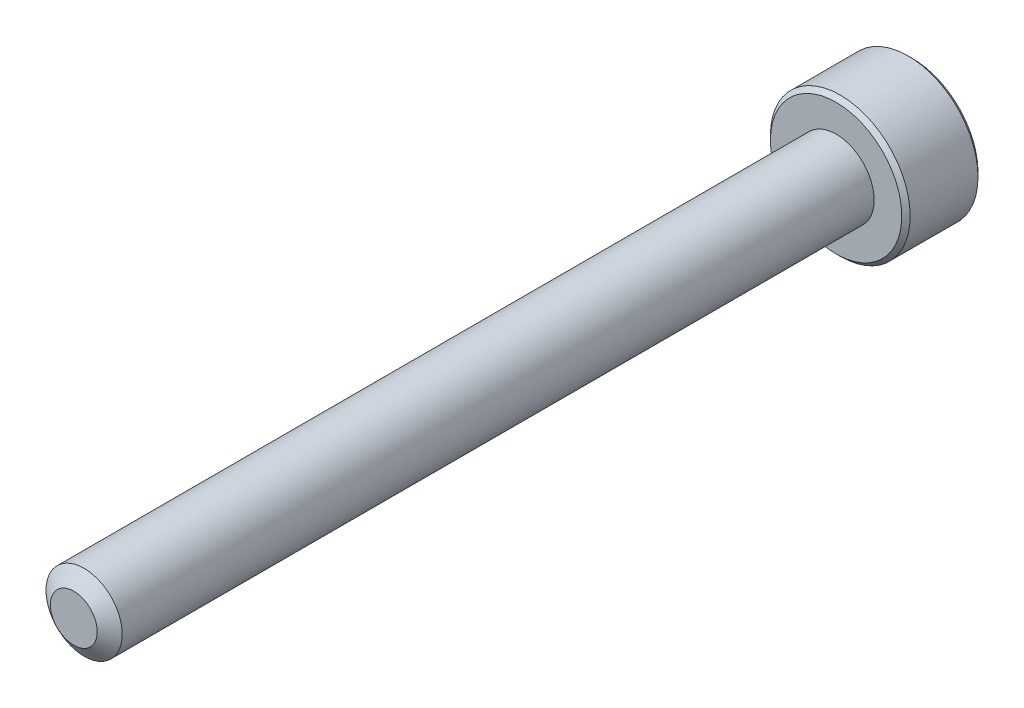
ISO-10303-21;
HEADER;
FILE_DESCRIPTION(('STEP AP214'),'2;1');
FILE_NAME('part.step','',(''),(''),'','','');
FILE_SCHEMA(('AUTOMOTIVE_DESIGN { 1 0 10303 214 1 1 1 1 }'));
ENDSEC;
DATA;
#1=APPLICATION_CONTEXT('core data for automotive mechanical design processes');
#2=APPLICATION_PROTOCOL_DEFINITION('international standard','automotive_design',2000,#1);
#3=PRODUCT_CONTEXT('',#1,'mechanical');
#4=PRODUCT('Part','Part','',(#3));
#5=PRODUCT_RELATED_PRODUCT_CATEGORY('part','',(#4));
#6=PRODUCT_DEFINITION_FORMATION('','',#4);
#7=PRODUCT_DEFINITION_CONTEXT('part definition',#1,'design');
#8=PRODUCT_DEFINITION('design','',#6,#7);
#9=PRODUCT_DEFINITION_SHAPE('','',#8);
#10=(LENGTH_UNIT() NAMED_UNIT(*) SI_UNIT(.MILLI.,.METRE.));
#11=(NAMED_UNIT(*) PLANE_ANGLE_UNIT() SI_UNIT($,.RADIAN.));
#12=(NAMED_UNIT(*) SI_UNIT($,.STERADIAN.) SOLID_ANGLE_UNIT());
#13=UNCERTAINTY_MEASURE_WITH_UNIT(LENGTH_MEASURE(1.E-05),#10,'distance_accuracy_value','');
#14=(GEOMETRIC_REPRESENTATION_CONTEXT(3) GLOBAL_UNCERTAINTY_ASSIGNED_CONTEXT((#13)) GLOBAL_UNIT_ASSIGNED_CONTEXT((#10,
#11,#12)) REPRESENTATION_CONTEXT('',''));
#15=CARTESIAN_POINT('',(0.,0.,0.));
#16=DIRECTION('',(0.,0.,1.));
#17=DIRECTION('',(1.,0.,0.));
#18=AXIS2_PLACEMENT_3D('',#15,#16,#17);
#19=CARTESIAN_POINT('',(0.,-1.44337567297406,-31.125));
#20=DIRECTION('',(-0.5,-0.866025403784439,0.));
#21=DIRECTION('',(0.866025403784439,-0.5,0.));
#22=AXIS2_PLACEMENT_3D('',#19,#20,#21);
#23=PLANE('',#22);
#24=CARTESIAN_POINT('',(-1.24999999999719,-0.721687836488653,-33.0000000000106));
#25=CARTESIAN_POINT('',(-1.20703689149334,-0.746492598748569,-32.9752190397288));
#26=CARTESIAN_POINT('',(-1.16335543595188,-0.771712098864028,-32.9518937494737));
#27=CARTESIAN_POINT('',(-1.07428446543455,-0.823137247669188,-32.9091861389212));
#28=CARTESIAN_POINT('',(-1.02888648443341,-0.849347784220863,-32.8898275733605));
#29=CARTESIAN_POINT('',(-0.937343688520915,-0.902200042083313,-32.8566662159147));
#30=CARTESIAN_POINT('',(-0.891222174140705,-0.928828310826161,-32.8427800967852));
#31=CARTESIAN_POINT('',(-0.79796403889092,-0.982670920316747,-32.8213859018018));
#32=CARTESIAN_POINT('',(-0.750830264933392,-1.00988361739905,-32.8138618619237));
#33=CARTESIAN_POINT('',(-0.669590913521733,-1.05678717880536,-32.8070728277984));
#34=CARTESIAN_POINT('',(-0.635590177984294,-1.07641751262055,-32.8060681886569));
#35=CARTESIAN_POINT('',(-0.567648554675317,-1.11564362712716,-32.8077634952234));
#36=CARTESIAN_POINT('',(-0.533707681782074,-1.13523939922861,-32.8104642592638));
#37=CARTESIAN_POINT('',(-0.466153619735585,-1.174241755136,-32.8194142483472));
#38=CARTESIAN_POINT('',(-0.432540764897262,-1.19364814592514,-32.8256667730595));
#39=CARTESIAN_POINT('',(-0.365876260757552,-1.23213691533559,-32.8413835392478));
#40=CARTESIAN_POINT('',(-0.332824858668373,-1.25121915122888,-32.8508491588607));
#41=CARTESIAN_POINT('',(-0.248213569936039,-1.30006950155497,-32.8789283315822));
#42=CARTESIAN_POINT('',(-0.197186124432403,-1.32953021095255,-32.8996493450655));
#43=CARTESIAN_POINT('',(-0.0971276056231052,-1.38729902372182,-32.9463235058209));
#44=CARTESIAN_POINT('',(-0.0480906425397016,-1.41561052755826,-32.9722596212326));
#45=CARTESIAN_POINT('',(-2.80957824535407E-12,-1.44337567297244,-33.0000000000106));
#46=B_SPLINE_CURVE_WITH_KNOTS('',3,(#24,#25,#26,#27,#28,#29,#30,#31,#32,#33,#34,#35,#36,#37,#38,
#39,#40,#41,#42,#43,#44,#45),.UNSPECIFIED.,.F.,.F.,(4,2,2,2,2,2,2,2,2,2,4),(0.,
0.166478683225078,0.333926926831281,0.498716658516144,0.663091654625516,0.780745575557468,
0.898425484350478,1.01621489976922,1.13405490052337,1.32111591641063,1.50757565757894),.UNSPECIFIED.);
#47=CARTESIAN_POINT('',(-1.25000000000136,-0.721687836486245,-33.0000000000131));
#48=VERTEX_POINT('',#47);
#49=CARTESIAN_POINT('',(-4.16671953249464E-12,-1.44337567297485,-33.0000000000131));
#50=VERTEX_POINT('',#49);
#51=EDGE_CURVE('E21',#48,#50,#46,.T.);
#52=ORIENTED_EDGE('',*,*,#51,.F.);
#53=DIRECTION('',(0.,0.,1.));
#54=VECTOR('',#53,1.);
#55=CARTESIAN_POINT('',(-1.25,-0.721687836487032,-31.125));
#56=LINE('',#55,#54);
#57=CARTESIAN_POINT('',(-1.25,-0.721687836487031,-31.125));
#58=VERTEX_POINT('',#57);
#59=EDGE_CURVE('E104',#48,#58,#56,.T.);
#60=ORIENTED_EDGE('',*,*,#59,.T.);
#61=DIRECTION('',(0.866025403784439,-0.5,0.));
#62=VECTOR('',#61,1.);
#63=CARTESIAN_POINT('',(0.,-1.44337567297406,-31.125));
#64=LINE('',#63,#62);
#65=CARTESIAN_POINT('',(0.,-1.44337567297406,-31.125));
#66=VERTEX_POINT('',#65);
#67=EDGE_CURVE('E77',#66,#58,#64,.F.);
#68=ORIENTED_EDGE('',*,*,#67,.F.);
#69=DIRECTION('',(0.,0.,1.));
#70=VECTOR('',#69,1.);
#71=CARTESIAN_POINT('',(0.,-1.44337567297406,-31.125));
#72=LINE('',#71,#70);
#73=EDGE_CURVE('E76',#66,#50,#72,.F.);
#74=ORIENTED_EDGE('',*,*,#73,.T.);
#75=EDGE_LOOP('',(#52,#60,#68,#74));
#76=FACE_BOUND('',#75,.T.);
#77=ADVANCED_FACE('F17',(#76),#23,.F.);
#78=CARTESIAN_POINT('',(1.25,-0.721687836487033,-31.125));
#79=DIRECTION('',(0.5,-0.866025403784439,0.));
#80=DIRECTION('',(0.866025403784439,0.5,0.));
#81=AXIS2_PLACEMENT_3D('',#78,#79,#80);
#82=PLANE('',#81);
#83=CARTESIAN_POINT('',(2.81411783743714E-12,-1.44337567297244,-33.0000000000106));
#84=CARTESIAN_POINT('',(0.0429631085066566,-1.41857091071252,-32.9752190397288));
#85=CARTESIAN_POINT('',(0.0866445640481205,-1.39335141059707,-32.9518937494737));
#86=CARTESIAN_POINT('',(0.175715534565449,-1.3419262617919,-32.9091861389212));
#87=CARTESIAN_POINT('',(0.221113515566591,-1.31571572524023,-32.8898275733605));
#88=CARTESIAN_POINT('',(0.312656311479088,-1.26286346737778,-32.8566662159147));
#89=CARTESIAN_POINT('',(0.358777825859299,-1.23623519863493,-32.8427800967852));
#90=CARTESIAN_POINT('',(0.452035961109083,-1.18239258914434,-32.8213859018018));
#91=CARTESIAN_POINT('',(0.49916973506661,-1.15517989206204,-32.8138618619237));
#92=CARTESIAN_POINT('',(0.58040908647827,-1.10827633065573,-32.8070728277984));
#93=CARTESIAN_POINT('',(0.614409822015708,-1.08864599684055,-32.8060681886569));
#94=CARTESIAN_POINT('',(0.682351445324686,-1.04941988233393,-32.8077634952234));
#95=CARTESIAN_POINT('',(0.716292318217928,-1.02982411023248,-32.8104642592638));
#96=CARTESIAN_POINT('',(0.783846380264418,-0.99082175432509,-32.8194142483472));
#97=CARTESIAN_POINT('',(0.817459235102742,-0.971415363535952,-32.8256667730595));
#98=CARTESIAN_POINT('',(0.884123739242452,-0.932926594125497,-32.8413835392478));
#99=CARTESIAN_POINT('',(0.91717514133163,-0.913844358232215,-32.8508491588607));
#100=CARTESIAN_POINT('',(1.00178643006396,-0.864994007906121,-32.8789283315822));
#101=CARTESIAN_POINT('',(1.0528138755676,-0.835533298508539,-32.8996493450655));
#102=CARTESIAN_POINT('',(1.15287239437689,-0.777764485739277,-32.9463235058209));
#103=CARTESIAN_POINT('',(1.2019093574603,-0.749452981902834,-32.9722596212326));
#104=CARTESIAN_POINT('',(1.24999999999719,-0.721687836488658,-33.0000000000106));
#105=B_SPLINE_CURVE_WITH_KNOTS('',3,(#83,#84,#85,#86,#87,#88,#89,#90,#91,#92,#93,#94,#95,#96,
#97,#98,#99,#100,#101,#102,#103,#104),.UNSPECIFIED.,.F.,.F.,(4,2,2,2,2,2,2,2,2,2,4),(0.,
0.166478683225079,0.333926926831284,0.498716658516146,0.663091654625518,0.78074557555747,
0.89842548435048,1.01621489976923,1.13405490052337,1.32111591641063,1.50757565757893),.UNSPECIFIED.);
#106=CARTESIAN_POINT('',(1.24999999999859,-0.721687836491034,-33.0000000000131));
#107=VERTEX_POINT('',#106);
#108=EDGE_CURVE('E84',#50,#107,#105,.T.);
#109=ORIENTED_EDGE('',*,*,#108,.F.);
#110=ORIENTED_EDGE('',*,*,#73,.F.);
#111=DIRECTION('',(-0.86602540378444,-0.499999999999997,0.));
#112=VECTOR('',#111,1.);
#113=CARTESIAN_POINT('',(1.25,-0.721687836487033,-31.125));
#114=LINE('',#113,#112);
#115=CARTESIAN_POINT('',(1.25,-0.721687836487033,-31.125));
#116=VERTEX_POINT('',#115);
#117=EDGE_CURVE('E272',#116,#66,#114,.T.);
#118=ORIENTED_EDGE('',*,*,#117,.F.);
#119=DIRECTION('',(0.,0.,-1.));
#120=VECTOR('',#119,1.);
#121=CARTESIAN_POINT('',(1.25,-0.721687836487033,-31.125));
#122=LINE('',#121,#120);
#123=EDGE_CURVE('E103',#116,#107,#122,.T.);
#124=ORIENTED_EDGE('',*,*,#123,.T.);
#125=EDGE_LOOP('',(#109,#110,#118,#124));
#126=FACE_BOUND('',#125,.T.);
#127=ADVANCED_FACE('F101',(#126),#82,.F.);
#128=CARTESIAN_POINT('',(-1.25,-0.721687836487032,-31.125));
#129=DIRECTION('',(-1.,0.,0.));
#130=DIRECTION('',(0.,-1.,0.));
#131=AXIS2_PLACEMENT_3D('',#128,#129,#130);
#132=PLANE('',#131);
#133=CARTESIAN_POINT('',(-1.25,0.721687836483783,-33.0000000000106));
#134=CARTESIAN_POINT('',(-1.25,0.672078311963948,-32.9752190397288));
#135=CARTESIAN_POINT('',(-1.25,0.621639311733029,-32.9518937494737));
#136=CARTESIAN_POINT('',(-1.25,0.518789014122708,-32.9091861389212));
#137=CARTESIAN_POINT('',(-1.25,0.46636794101936,-32.8898275733605));
#138=CARTESIAN_POINT('',(-1.25,0.360663425294459,-32.8566662159147));
#139=CARTESIAN_POINT('',(-1.25,0.307406887808763,-32.8427800967852));
#140=CARTESIAN_POINT('',(-1.25,0.199721668827592,-32.8213859018018));
#141=CARTESIAN_POINT('',(-1.25,0.145296274662989,-32.8138618619237));
#142=CARTESIAN_POINT('',(-1.25,0.0514891518503645,-32.8070728277984));
#143=CARTESIAN_POINT('',(-1.25,0.0122284842199936,-32.8060681886569));
#144=CARTESIAN_POINT('',(-1.25,-0.066223744793243,-32.8077634952234));
#145=CARTESIAN_POINT('',(-1.25,-0.105415288996132,-32.8104642592638));
#146=CARTESIAN_POINT('',(-1.25,-0.183420000810919,-32.8194142483472));
#147=CARTESIAN_POINT('',(-1.25,-0.222232782389194,-32.8256667730595));
#148=CARTESIAN_POINT('',(-1.25,-0.299210321210103,-32.8413835392478));
#149=CARTESIAN_POINT('',(-1.25,-0.337374792996667,-32.8508491588607));
#150=CARTESIAN_POINT('',(-1.25,-0.435075493648855,-32.8789283315822));
#151=CARTESIAN_POINT('',(-1.25,-0.493996912444021,-32.8996493450655));
#152=CARTESIAN_POINT('',(-1.25,-0.609534537982544,-32.9463235058209));
#153=CARTESIAN_POINT('',(-1.25,-0.666157545655431,-32.9722596212326));
#154=CARTESIAN_POINT('',(-1.25,-0.721687836483782,-33.0000000000106));
#155=B_SPLINE_CURVE_WITH_KNOTS('',3,(#133,#134,#135,#136,#137,#138,#139,#140,#141,#142,#143,
#144,#145,#146,#147,#148,#149,#150,#151,#152,#153,#154),.UNSPECIFIED.,.F.,.F.,(4,2,2,2,2,2,2,2,
2,2,4),(0.,0.166478683225082,0.333926926831283,0.498716658516146,0.663091654625519,
0.78074557555747,0.89842548435048,1.01621489976923,1.13405490052337,1.32111591641063,
1.50757565757893),.UNSPECIFIED.);
#156=CARTESIAN_POINT('',(-1.25,0.721687836488597,-33.0000000000131));
#157=VERTEX_POINT('',#156);
#158=EDGE_CURVE('E61',#157,#48,#155,.T.);
#159=ORIENTED_EDGE('',*,*,#158,.F.);
#160=DIRECTION('',(0.,0.,1.));
#161=VECTOR('',#160,1.);
#162=CARTESIAN_POINT('',(-1.25,0.721687836487032,-31.125));
#163=LINE('',#162,#161);
#164=CARTESIAN_POINT('',(-1.25,0.721687836487032,-31.125));
#165=VERTEX_POINT('',#164);
#166=EDGE_CURVE('E249',#157,#165,#163,.T.);
#167=ORIENTED_EDGE('',*,*,#166,.T.);
#168=DIRECTION('',(0.,1.,0.));
#169=VECTOR('',#168,1.);
#170=CARTESIAN_POINT('',(-1.25,2.1650635094611,-31.125));
#171=LINE('',#170,#169);
#172=EDGE_CURVE('E268',#58,#165,#171,.T.);
#173=ORIENTED_EDGE('',*,*,#172,.F.);
#174=ORIENTED_EDGE('',*,*,#59,.F.);
#175=EDGE_LOOP('',(#159,#167,#173,#174));
#176=FACE_BOUND('',#175,.T.);
#177=ADVANCED_FACE('F122',(#176),#132,.F.);
#178=CARTESIAN_POINT('',(1.25,2.1650635094611,-31.125));
#179=DIRECTION('',(0.,0.,-1.));
#180=DIRECTION('',(-1.,0.,0.));
#181=AXIS2_PLACEMENT_3D('',#178,#179,#180);
#182=PLANE('',#181);
#183=ORIENTED_EDGE('',*,*,#67,.T.);
#184=ORIENTED_EDGE('',*,*,#172,.T.);
#185=DIRECTION('',(-0.866025403784439,-0.5,0.));
#186=VECTOR('',#185,1.);
#187=CARTESIAN_POINT('',(-1.25,0.721687836487032,-31.125));
#188=LINE('',#187,#186);
#189=CARTESIAN_POINT('',(0.,1.44337567297406,-31.125));
#190=VERTEX_POINT('',#189);
#191=EDGE_CURVE('E144',#165,#190,#188,.F.);
#192=ORIENTED_EDGE('',*,*,#191,.T.);
#193=DIRECTION('',(-0.866025403784439,0.5,0.));
#194=VECTOR('',#193,1.);
#195=CARTESIAN_POINT('',(0.,1.44337567297406,-31.125));
#196=LINE('',#195,#194);
#197=CARTESIAN_POINT('',(1.25,0.721687836487029,-31.125));
#198=VERTEX_POINT('',#197);
#199=EDGE_CURVE('E246',#190,#198,#196,.F.);
#200=ORIENTED_EDGE('',*,*,#199,.T.);
#201=DIRECTION('',(0.,1.,0.));
#202=VECTOR('',#201,1.);
#203=CARTESIAN_POINT('',(1.25,0.721687836487032,-31.125));
#204=LINE('',#203,#202);
#205=EDGE_CURVE('E263',#198,#116,#204,.F.);
#206=ORIENTED_EDGE('',*,*,#205,.T.);
#207=ORIENTED_EDGE('',*,*,#117,.T.);
#208=EDGE_LOOP('',(#183,#184,#192,#200,#206,#207));
#209=FACE_BOUND('',#208,.T.);
#210=ADVANCED_FACE('F126',(#209),#182,.T.);
#211=CARTESIAN_POINT('',(1.25,0.721687836487032,-31.125));
#212=DIRECTION('',(1.,0.,0.));
#213=DIRECTION('',(0.,0.,-1.));
#214=AXIS2_PLACEMENT_3D('',#211,#212,#213);
#215=PLANE('',#214);
#216=CARTESIAN_POINT('',(1.25,-0.721687836483783,-33.0000000000106));
#217=CARTESIAN_POINT('',(1.25,-0.672078311963948,-32.9752190397288));
#218=CARTESIAN_POINT('',(1.25,-0.621639311733029,-32.9518937494737));
#219=CARTESIAN_POINT('',(1.25,-0.518789014122707,-32.9091861389212));
#220=CARTESIAN_POINT('',(1.25,-0.466367941019357,-32.8898275733605));
#221=CARTESIAN_POINT('',(1.25,-0.360663425294455,-32.8566662159147));
#222=CARTESIAN_POINT('',(1.25,-0.307406887808759,-32.8427800967852));
#223=CARTESIAN_POINT('',(1.25,-0.199721668827589,-32.8213859018018));
#224=CARTESIAN_POINT('',(1.25,-0.145296274662988,-32.8138618619237));
#225=CARTESIAN_POINT('',(1.25,-0.0514891518503652,-32.8070728277984));
#226=CARTESIAN_POINT('',(1.25,-0.0122284842199946,-32.8060681886569));
#227=CARTESIAN_POINT('',(1.25,0.0662237447932413,-32.8077634952234));
#228=CARTESIAN_POINT('',(1.25,0.10541528899613,-32.8104642592638));
#229=CARTESIAN_POINT('',(1.25,0.183420000810917,-32.8194142483472));
#230=CARTESIAN_POINT('',(1.25,0.222232782389193,-32.8256667730595));
#231=CARTESIAN_POINT('',(1.25,0.299210321210102,-32.8413835392478));
#232=CARTESIAN_POINT('',(1.25,0.337374792996666,-32.8508491588607));
#233=CARTESIAN_POINT('',(1.25,0.435075493649003,-32.8789283315822));
#234=CARTESIAN_POINT('',(1.25,0.493996912444312,-32.8996493450656));
#235=CARTESIAN_POINT('',(1.25,0.609534537983112,-32.9463235058211));
#236=CARTESIAN_POINT('',(1.25,0.666157545656132,-32.9722596212329));
#237=CARTESIAN_POINT('',(1.25,0.721687836484612,-33.0000000000111));
#238=B_SPLINE_CURVE_WITH_KNOTS('',3,(#216,#217,#218,#219,#220,#221,#222,#223,#224,#225,#226,
#227,#228,#229,#230,#231,#232,#233,#234,#235,#236,#237),.UNSPECIFIED.,.F.,.F.,(4,2,2,2,2,2,2,2,
2,2,4),(0.,0.166478683225082,0.333926926831288,0.498716658516149,0.663091654625518,
0.780745575557469,0.898425484350478,1.01621489976923,1.13405490052337,1.32111591641109,
1.50757565757986),.UNSPECIFIED.);
#239=CARTESIAN_POINT('',(1.25000000000033,0.721687836488433,-33.0000000000133));
#240=VERTEX_POINT('',#239);
#241=EDGE_CURVE('E40',#107,#240,#238,.T.);
#242=ORIENTED_EDGE('',*,*,#241,.F.);
#243=ORIENTED_EDGE('',*,*,#123,.F.);
#244=ORIENTED_EDGE('',*,*,#205,.F.);
#245=DIRECTION('',(0.,0.,1.));
#246=VECTOR('',#245,1.);
#247=CARTESIAN_POINT('',(1.25,0.721687836487029,-31.125));
#248=LINE('',#247,#246);
#249=EDGE_CURVE('E242',#198,#240,#248,.F.);
#250=ORIENTED_EDGE('',*,*,#249,.T.);
#251=EDGE_LOOP('',(#242,#243,#244,#250));
#252=FACE_BOUND('',#251,.T.);
#253=ADVANCED_FACE('F130',(#252),#215,.F.);
#254=CARTESIAN_POINT('',(-1.25,0.721687836487032,-31.125));
#255=DIRECTION('',(-0.5,0.866025403784439,0.));
#256=DIRECTION('',(-0.866025403784439,-0.5,0.));
#257=AXIS2_PLACEMENT_3D('',#254,#255,#256);
#258=PLANE('',#257);
#259=CARTESIAN_POINT('',(-2.09632003303961E-12,1.44337567297285,-33.0000000000111));
#260=CARTESIAN_POINT('',(-0.0429631085059828,1.41857091071291,-32.9752190397292));
#261=CARTESIAN_POINT('',(-0.0866445640474911,1.39335141059743,-32.9518937494741));
#262=CARTESIAN_POINT('',(-0.175715534564911,1.34192626179221,-32.9091861389215));
#263=CARTESIAN_POINT('',(-0.221113515566101,1.31571572524051,-32.8898275733607));
#264=CARTESIAN_POINT('',(-0.312656311478696,1.262863467378,-32.8566662159148));
#265=CARTESIAN_POINT('',(-0.358777825858958,1.23623519863513,-32.8427800967853));
#266=CARTESIAN_POINT('',(-0.452035961108846,1.18239258914448,-32.8213859018019));
#267=CARTESIAN_POINT('',(-0.499169735066427,1.15517989206215,-32.8138618619237));
#268=CARTESIAN_POINT('',(-0.580409086478143,1.1082763306558,-32.8070728277984));
#269=CARTESIAN_POINT('',(-0.614409822015584,1.08864599684062,-32.8060681886569));
#270=CARTESIAN_POINT('',(-0.682351445324567,1.049419882334,-32.8077634952234));
#271=CARTESIAN_POINT('',(-0.716292318217812,1.02982411023255,-32.8104642592638));
#272=CARTESIAN_POINT('',(-0.783846380264307,0.990821754325153,-32.8194142483471));
#273=CARTESIAN_POINT('',(-0.817459235102632,0.971415363536014,-32.8256667730595));
#274=CARTESIAN_POINT('',(-0.884123739242347,0.932926594125557,-32.8413835392478));
#275=CARTESIAN_POINT('',(-0.91717514133153,0.913844358232273,-32.8508491588607));
#276=CARTESIAN_POINT('',(-1.00178643006388,0.864994007906168,-32.8789283315821));
#277=CARTESIAN_POINT('',(-1.05281387556753,0.835533298508576,-32.8996493450654));
#278=CARTESIAN_POINT('',(-1.15287239437686,0.777764485739296,-32.9463235058209));
#279=CARTESIAN_POINT('',(-1.20190935746028,0.749452981902842,-32.9722596212326));
#280=CARTESIAN_POINT('',(-1.24999999999719,0.721687836488657,-33.0000000000106));
#281=B_SPLINE_CURVE_WITH_KNOTS('',3,(#259,#260,#261,#262,#263,#264,#265,#266,#267,#268,#269,
#270,#271,#272,#273,#274,#275,#276,#277,#278,#279,#280),.UNSPECIFIED.,.F.,.F.,(4,2,2,2,2,2,2,2,
2,2,4),(0.,0.166478683225274,0.333926926831679,0.498716658516734,0.663091654626296,
0.780745575558257,0.898425484351275,1.01621489977003,1.13405490052418,1.32111591641149,
1.50757565757986),.UNSPECIFIED.);
#282=CARTESIAN_POINT('',(-1.71900959987395E-12,1.44337567297505,-33.0000000000133));
#283=VERTEX_POINT('',#282);
#284=EDGE_CURVE('E145',#283,#157,#281,.T.);
#285=ORIENTED_EDGE('',*,*,#284,.F.);
#286=DIRECTION('',(0.,0.,1.));
#287=VECTOR('',#286,1.);
#288=CARTESIAN_POINT('',(0.,1.44337567297406,-31.125));
#289=LINE('',#288,#287);
#290=EDGE_CURVE('E170',#283,#190,#289,.T.);
#291=ORIENTED_EDGE('',*,*,#290,.T.);
#292=ORIENTED_EDGE('',*,*,#191,.F.);
#293=ORIENTED_EDGE('',*,*,#166,.F.);
#294=EDGE_LOOP('',(#285,#291,#292,#293));
#295=FACE_BOUND('',#294,.T.);
#296=ADVANCED_FACE('F135',(#295),#258,.F.);
#297=CARTESIAN_POINT('',(0.,1.44337567297406,-31.125));
#298=DIRECTION('',(0.5,0.866025403784439,0.));
#299=DIRECTION('',(-0.866025403784439,0.5,0.));
#300=AXIS2_PLACEMENT_3D('',#297,#298,#299);
#301=PLANE('',#300);
#302=CARTESIAN_POINT('',(2.09347186406145E-12,1.44337567297285,-33.0000000000111));
#303=CARTESIAN_POINT('',(0.042963108505979,1.41857091071291,-32.9752190397292));
#304=CARTESIAN_POINT('',(0.0866445640474883,1.39335141059743,-32.951893749474));
#305=CARTESIAN_POINT('',(0.175715534564911,1.34192626179221,-32.9091861389215));
#306=CARTESIAN_POINT('',(0.221113515566101,1.31571572524051,-32.8898275733607));
#307=CARTESIAN_POINT('',(0.312656311478697,1.262863467378,-32.8566662159148));
#308=CARTESIAN_POINT('',(0.358777825858957,1.23623519863512,-32.8427800967853));
#309=CARTESIAN_POINT('',(0.452035961108844,1.18239258914448,-32.8213859018019));
#310=CARTESIAN_POINT('',(0.499169735066425,1.15517989206215,-32.8138618619237));
#311=CARTESIAN_POINT('',(0.58040908647814,1.1082763306558,-32.8070728277984));
#312=CARTESIAN_POINT('',(0.614409822015581,1.08864599684061,-32.8060681886569));
#313=CARTESIAN_POINT('',(0.682351445324563,1.04941988233399,-32.8077634952234));
#314=CARTESIAN_POINT('',(0.716292318217808,1.02982411023255,-32.8104642592638));
#315=CARTESIAN_POINT('',(0.783846380264303,0.990821754325151,-32.8194142483471));
#316=CARTESIAN_POINT('',(0.81745923510263,0.971415363536012,-32.8256667730595));
#317=CARTESIAN_POINT('',(0.884123739242345,0.932926594125554,-32.8413835392478));
#318=CARTESIAN_POINT('',(0.917175141331527,0.91384435823227,-32.8508491588607));
#319=CARTESIAN_POINT('',(1.00178643006401,0.864994007906091,-32.8789283315822));
#320=CARTESIAN_POINT('',(1.05281387556778,0.835533298508428,-32.8996493450656));
#321=CARTESIAN_POINT('',(1.15287239437735,0.777764485739009,-32.9463235058211));
#322=CARTESIAN_POINT('',(1.20190935746088,0.749452981902489,-32.9722596212329));
#323=CARTESIAN_POINT('',(1.2499999999979,0.72168783648824,-33.0000000000111));
#324=B_SPLINE_CURVE_WITH_KNOTS('',3,(#302,#303,#304,#305,#306,#307,#308,#309,#310,#311,#312,
#313,#314,#315,#316,#317,#318,#319,#320,#321,#322,#323),.UNSPECIFIED.,.F.,.F.,(4,2,2,2,2,2,2,2,
2,2,4),(0.,0.166478683225279,0.333926926831683,0.498716658516736,0.663091654626297,
0.780745575558257,0.898425484351274,1.01621489977003,1.13405490052418,1.32111591641196,
1.50757565758079),.UNSPECIFIED.);
#325=EDGE_CURVE('E162',#283,#240,#324,.T.);
#326=ORIENTED_EDGE('',*,*,#325,.T.);
#327=ORIENTED_EDGE('',*,*,#249,.F.);
#328=ORIENTED_EDGE('',*,*,#199,.F.);
#329=ORIENTED_EDGE('',*,*,#290,.F.);
#330=EDGE_LOOP('',(#326,#327,#328,#329));
#331=FACE_BOUND('',#330,.T.);
#332=ADVANCED_FACE('F172',(#331),#301,.F.);
#333=CARTESIAN_POINT('',(0.,0.,-32.9999999999586));
#334=DIRECTION('',(0.,0.,-1.));
#335=DIRECTION('',(-1.,0.,0.));
#336=AXIS2_PLACEMENT_3D('',#333,#334,#335);
#337=CONICAL_SURFACE('',#336,1.44337567292041,0.785398163397448);
#338=ORIENTED_EDGE('',*,*,#284,.T.);
#339=CARTESIAN_POINT('',(0.,0.,-33.0000000000155));
#340=DIRECTION('',(0.,0.,-1.));
#341=DIRECTION('',(-1.,0.,0.));
#342=AXIS2_PLACEMENT_3D('',#339,#340,#341);
#343=CIRCLE('',#342,1.44337567297725);
#344=EDGE_CURVE('E169',#283,#157,#343,.F.);
#345=ORIENTED_EDGE('',*,*,#344,.F.);
#346=EDGE_LOOP('',(#338,#345));
#347=FACE_BOUND('',#346,.T.);
#348=ADVANCED_FACE('F175',(#347),#337,.F.);
#349=CARTESIAN_POINT('',(0.,0.,-32.9999999999586));
#350=DIRECTION('',(0.,0.,-1.));
#351=DIRECTION('',(-1.,0.,0.));
#352=AXIS2_PLACEMENT_3D('',#349,#350,#351);
#353=CONICAL_SURFACE('',#352,1.44337567292041,0.785398163397448);
#354=CARTESIAN_POINT('',(0.,0.,-33.0000000000155));
#355=DIRECTION('',(0.,0.,-1.));
#356=DIRECTION('',(-1.,0.,0.));
#357=AXIS2_PLACEMENT_3D('',#354,#355,#356);
#358=CIRCLE('',#357,1.44337567297725);
#359=EDGE_CURVE('E94',#157,#48,#358,.F.);
#360=ORIENTED_EDGE('',*,*,#359,.F.);
#361=ORIENTED_EDGE('',*,*,#158,.T.);
#362=EDGE_LOOP('',(#360,#361));
#363=FACE_BOUND('',#362,.T.);
#364=ADVANCED_FACE('F179',(#363),#353,.F.);
#365=CARTESIAN_POINT('',(0.,0.,-32.9999999999586));
#366=DIRECTION('',(0.,0.,-1.));
#367=DIRECTION('',(-1.,0.,0.));
#368=AXIS2_PLACEMENT_3D('',#365,#366,#367);
#369=CONICAL_SURFACE('',#368,1.44337567292041,0.785398163397448);
#370=ORIENTED_EDGE('',*,*,#51,.T.);
#371=CARTESIAN_POINT('',(0.,0.,-33.0000000000155));
#372=DIRECTION('',(0.,0.,-1.));
#373=DIRECTION('',(-1.,0.,0.));
#374=AXIS2_PLACEMENT_3D('',#371,#372,#373);
#375=CIRCLE('',#374,1.44337567297725);
#376=EDGE_CURVE('E72',#48,#50,#375,.F.);
#377=ORIENTED_EDGE('',*,*,#376,.F.);
#378=EDGE_LOOP('',(#370,#377));
#379=FACE_BOUND('',#378,.T.);
#380=ADVANCED_FACE('F70',(#379),#369,.F.);
#381=CARTESIAN_POINT('',(0.,0.,-32.9999999999586));
#382=DIRECTION('',(0.,0.,-1.));
#383=DIRECTION('',(-1.,0.,0.));
#384=AXIS2_PLACEMENT_3D('',#381,#382,#383);
#385=CONICAL_SURFACE('',#384,1.44337567292041,0.785398163397448);
#386=ORIENTED_EDGE('',*,*,#108,.T.);
#387=CARTESIAN_POINT('',(0.,0.,-33.0000000000155));
#388=DIRECTION('',(0.,0.,-1.));
#389=DIRECTION('',(-1.,0.,0.));
#390=AXIS2_PLACEMENT_3D('',#387,#388,#389);
#391=CIRCLE('',#390,1.44337567297725);
#392=EDGE_CURVE('E92',#50,#107,#391,.F.);
#393=ORIENTED_EDGE('',*,*,#392,.F.);
#394=EDGE_LOOP('',(#386,#393));
#395=FACE_BOUND('',#394,.T.);
#396=ADVANCED_FACE('F97',(#395),#385,.F.);
#397=CARTESIAN_POINT('',(0.,0.,-32.9999999999586));
#398=DIRECTION('',(0.,0.,-1.));
#399=DIRECTION('',(-1.,0.,0.));
#400=AXIS2_PLACEMENT_3D('',#397,#398,#399);
#401=CONICAL_SURFACE('',#400,1.44337567292041,0.785398163397448);
#402=ORIENTED_EDGE('',*,*,#241,.T.);
#403=CARTESIAN_POINT('',(0.,0.,-33.0000000000155));
#404=DIRECTION('',(0.,0.,-1.));
#405=DIRECTION('',(-1.,0.,0.));
#406=AXIS2_PLACEMENT_3D('',#403,#404,#405);
#407=CIRCLE('',#406,1.44337567297725);
#408=EDGE_CURVE('E99',#107,#240,#407,.F.);
#409=ORIENTED_EDGE('',*,*,#408,.F.);
#410=EDGE_LOOP('',(#402,#409));
#411=FACE_BOUND('',#410,.T.);
#412=ADVANCED_FACE('F152',(#411),#401,.F.);
#413=CARTESIAN_POINT('',(0.,0.,-32.9999999999586));
#414=DIRECTION('',(0.,0.,-1.));
#415=DIRECTION('',(-1.,0.,0.));
#416=AXIS2_PLACEMENT_3D('',#413,#414,#415);
#417=CONICAL_SURFACE('',#416,1.44337567292041,0.785398163397448);
#418=ORIENTED_EDGE('',*,*,#325,.F.);
#419=CARTESIAN_POINT('',(0.,0.,-33.0000000000155));
#420=DIRECTION('',(0.,0.,-1.));
#421=DIRECTION('',(-1.,0.,0.));
#422=AXIS2_PLACEMENT_3D('',#419,#420,#421);
#423=CIRCLE('',#422,1.44337567297725);
#424=EDGE_CURVE('E234',#240,#283,#423,.F.);
#425=ORIENTED_EDGE('',*,*,#424,.F.);
#426=EDGE_LOOP('',(#418,#425));
#427=FACE_BOUND('',#426,.T.);
#428=ADVANCED_FACE('F156',(#427),#417,.F.);
#429=CARTESIAN_POINT('',(0.,0.,-33.));
#430=DIRECTION('',(0.,0.,-1.));
#431=DIRECTION('',(-1.,0.,0.));
#432=AXIS2_PLACEMENT_3D('',#429,#430,#431);
#433=PLANE('',#432);
#434=ORIENTED_EDGE('',*,*,#408,.T.);
#435=ORIENTED_EDGE('',*,*,#424,.T.);
#436=ORIENTED_EDGE('',*,*,#344,.T.);
#437=ORIENTED_EDGE('',*,*,#359,.T.);
#438=ORIENTED_EDGE('',*,*,#376,.T.);
#439=ORIENTED_EDGE('',*,*,#392,.T.);
#440=EDGE_LOOP('',(#434,#435,#436,#437,#438,#439));
#441=FACE_BOUND('',#440,.T.);
#442=CARTESIAN_POINT('',(0.,0.,-33.0000000000155));
#443=DIRECTION('',(0.,0.,1.));
#444=DIRECTION('',(1.,0.,0.));
#445=AXIS2_PLACEMENT_3D('',#442,#443,#444);
#446=CIRCLE('',#445,2.58500000006734);
#447=CARTESIAN_POINT('',(2.58500000006734,0.,-33.0000000000155));
#448=VERTEX_POINT('',#447);
#449=EDGE_CURVE('E225',#448,#448,#446,.T.);
#450=ORIENTED_EDGE('',*,*,#449,.F.);
#451=EDGE_LOOP('',(#450));
#452=FACE_BOUND('',#451,.T.);
#453=ADVANCED_FACE('F90',(#441,#452),#433,.T.);
#454=CARTESIAN_POINT('',(0.,0.,-32.8350000000341));
#455=DIRECTION('',(0.,0.,1.));
#456=DIRECTION('',(1.,0.,0.));
#457=AXIS2_PLACEMENT_3D('',#454,#455,#456);
#458=CONICAL_SURFACE('',#457,2.75000000004866,0.785398163397448);
#459=ORIENTED_EDGE('',*,*,#449,.T.);
#460=EDGE_LOOP('',(#459));
#461=FACE_BOUND('',#460,.T.);
#462=CARTESIAN_POINT('',(0.,0.,-32.835));
#463=DIRECTION('',(0.,0.,1.));
#464=DIRECTION('',(1.,0.,0.));
#465=AXIS2_PLACEMENT_3D('',#462,#463,#464);
#466=CIRCLE('',#465,2.75);
#467=CARTESIAN_POINT('',(2.75,0.,-32.835));
#468=VERTEX_POINT('',#467);
#469=EDGE_CURVE('E228',#468,#468,#466,.T.);
#470=ORIENTED_EDGE('',*,*,#469,.F.);
#471=EDGE_LOOP('',(#470));
#472=FACE_BOUND('',#471,.T.);
#473=ADVANCED_FACE('F215',(#461,#472),#458,.T.);
#474=CARTESIAN_POINT('',(0.,0.,-33.));
#475=DIRECTION('',(0.,0.,1.));
#476=DIRECTION('',(1.,0.,0.));
#477=AXIS2_PLACEMENT_3D('',#474,#475,#476);
#478=CYLINDRICAL_SURFACE('',#477,2.75);
#479=ORIENTED_EDGE('',*,*,#469,.T.);
#480=EDGE_LOOP('',(#479));
#481=FACE_BOUND('',#480,.T.);
#482=CARTESIAN_POINT('',(0.,0.,-30.1650000000109));
#483=DIRECTION('',(0.,0.,-1.));
#484=DIRECTION('',(-1.,0.,0.));
#485=AXIS2_PLACEMENT_3D('',#482,#483,#484);
#486=CIRCLE('',#485,2.74999999999181);
#487=CARTESIAN_POINT('',(-2.74999999999181,0.,-30.1650000000109));
#488=VERTEX_POINT('',#487);
#489=EDGE_CURVE('E229',#488,#488,#486,.F.);
#490=ORIENTED_EDGE('',*,*,#489,.F.);
#491=EDGE_LOOP('',(#490));
#492=FACE_BOUND('',#491,.T.);
#493=ADVANCED_FACE('F212',(#481,#492),#478,.T.);
#494=CARTESIAN_POINT('',(0.,0.,0.));
#495=DIRECTION('',(0.,0.,1.));
#496=DIRECTION('',(1.,0.,0.));
#497=AXIS2_PLACEMENT_3D('',#494,#495,#496);
#498=PLANE('',#497);
#499=CARTESIAN_POINT('',(0.,0.,5.6843418860808E-11));
#500=DIRECTION('',(0.,0.,-1.));
#501=DIRECTION('',(-1.,0.,0.));
#502=AXIS2_PLACEMENT_3D('',#499,#500,#501);
#503=CIRCLE('',#502,0.921240473587659);
#504=CARTESIAN_POINT('',(-0.921240473587659,0.,5.6843418860808E-11));
#505=VERTEX_POINT('',#504);
#506=EDGE_CURVE('E232',#505,#505,#503,.T.);
#507=ORIENTED_EDGE('',*,*,#506,.F.);
#508=EDGE_LOOP('',(#507));
#509=FACE_BOUND('',#508,.T.);
#510=ADVANCED_FACE('F208',(#509),#498,.T.);
#511=CARTESIAN_POINT('',(0.,0.,-30.1649999998972));
#512=DIRECTION('',(0.,0.,-1.));
#513=DIRECTION('',(-1.,0.,0.));
#514=AXIS2_PLACEMENT_3D('',#511,#512,#513);
#515=CONICAL_SURFACE('',#514,2.74999999993497,0.785398163569701);
#516=CARTESIAN_POINT('',(0.,0.,-30.0000000000296));
#517=DIRECTION('',(0.,0.,-1.));
#518=DIRECTION('',(-1.,0.,0.));
#519=AXIS2_PLACEMENT_3D('',#516,#517,#518);
#520=CIRCLE('',#519,2.5850000000105);
#521=CARTESIAN_POINT('',(-2.5850000000105,0.,-30.0000000000296));
#522=VERTEX_POINT('',#521);
#523=EDGE_CURVE('E287',#522,#522,#520,.T.);
#524=ORIENTED_EDGE('',*,*,#523,.T.);
#525=EDGE_LOOP('',(#524));
#526=FACE_BOUND('',#525,.T.);
#527=ORIENTED_EDGE('',*,*,#489,.T.);
#528=EDGE_LOOP('',(#527));
#529=FACE_BOUND('',#528,.T.);
#530=ADVANCED_FACE('F204',(#526,#529),#515,.T.);
#531=CARTESIAN_POINT('',(0.,0.,-0.405251783149652));
#532=DIRECTION('',(0.,0.,-1.));
#533=DIRECTION('',(-1.,0.,0.));
#534=AXIS2_PLACEMENT_3D('',#531,#532,#533);
#535=CONICAL_SURFACE('',#534,1.50000000002137,0.959931088612039);
#536=ORIENTED_EDGE('',*,*,#506,.T.);
#537=EDGE_LOOP('',(#536));
#538=FACE_BOUND('',#537,.T.);
#539=CARTESIAN_POINT('',(0.,0.,-0.405251783209382));
#540=DIRECTION('',(0.,0.,1.));
#541=DIRECTION('',(1.,0.,0.));
#542=AXIS2_PLACEMENT_3D('',#539,#540,#541);
#543=CIRCLE('',#542,1.5);
#544=CARTESIAN_POINT('',(1.5,0.,-0.405251783209382));
#545=VERTEX_POINT('',#544);
#546=EDGE_CURVE('E32',#545,#545,#543,.F.);
#547=ORIENTED_EDGE('',*,*,#546,.F.);
#548=EDGE_LOOP('',(#547));
#549=FACE_BOUND('',#548,.T.);
#550=ADVANCED_FACE('F197',(#538,#549),#535,.T.);
#551=CARTESIAN_POINT('',(0.,0.,-30.));
#552=DIRECTION('',(0.,0.,-1.));
#553=DIRECTION('',(-1.,0.,0.));
#554=AXIS2_PLACEMENT_3D('',#551,#552,#553);
#555=PLANE('',#554);
#556=CARTESIAN_POINT('',(0.,0.,-30.));
#557=DIRECTION('',(0.,0.,1.));
#558=DIRECTION('',(1.,0.,0.));
#559=AXIS2_PLACEMENT_3D('',#556,#557,#558);
#560=CIRCLE('',#559,1.5);
#561=CARTESIAN_POINT('',(1.5,0.,-30.));
#562=VERTEX_POINT('',#561);
#563=EDGE_CURVE('E11',#562,#562,#560,.T.);
#564=ORIENTED_EDGE('',*,*,#563,.F.);
#565=EDGE_LOOP('',(#564));
#566=FACE_BOUND('',#565,.T.);
#567=ORIENTED_EDGE('',*,*,#523,.F.);
#568=EDGE_LOOP('',(#567));
#569=FACE_BOUND('',#568,.T.);
#570=ADVANCED_FACE('F191',(#566,#569),#555,.F.);
#571=CARTESIAN_POINT('',(0.,0.,-30.));
#572=DIRECTION('',(0.,0.,1.));
#573=DIRECTION('',(1.,0.,0.));
#574=AXIS2_PLACEMENT_3D('',#571,#572,#573);
#575=CYLINDRICAL_SURFACE('',#574,1.5);
#576=ORIENTED_EDGE('',*,*,#563,.T.);
#577=EDGE_LOOP('',(#576));
#578=FACE_BOUND('',#577,.T.);
#579=ORIENTED_EDGE('',*,*,#546,.T.);
#580=EDGE_LOOP('',(#579));
#581=FACE_BOUND('',#580,.T.);
#582=ADVANCED_FACE('F189',(#578,#581),#575,.T.);
#583=CLOSED_SHELL('',(#77,#127,#177,#210,#253,#296,#332,#348,#364,#380,#396,#412,#428,#453,#473,
#493,#510,#530,#550,#570,#582));
#584=MANIFOLD_SOLID_BREP('B1',#583);
#585=ADVANCED_BREP_SHAPE_REPRESENTATION('',(#18,#584),#14);
#586=SHAPE_DEFINITION_REPRESENTATION(#9,#585);
ENDSEC;
END-ISO-10303-21;
